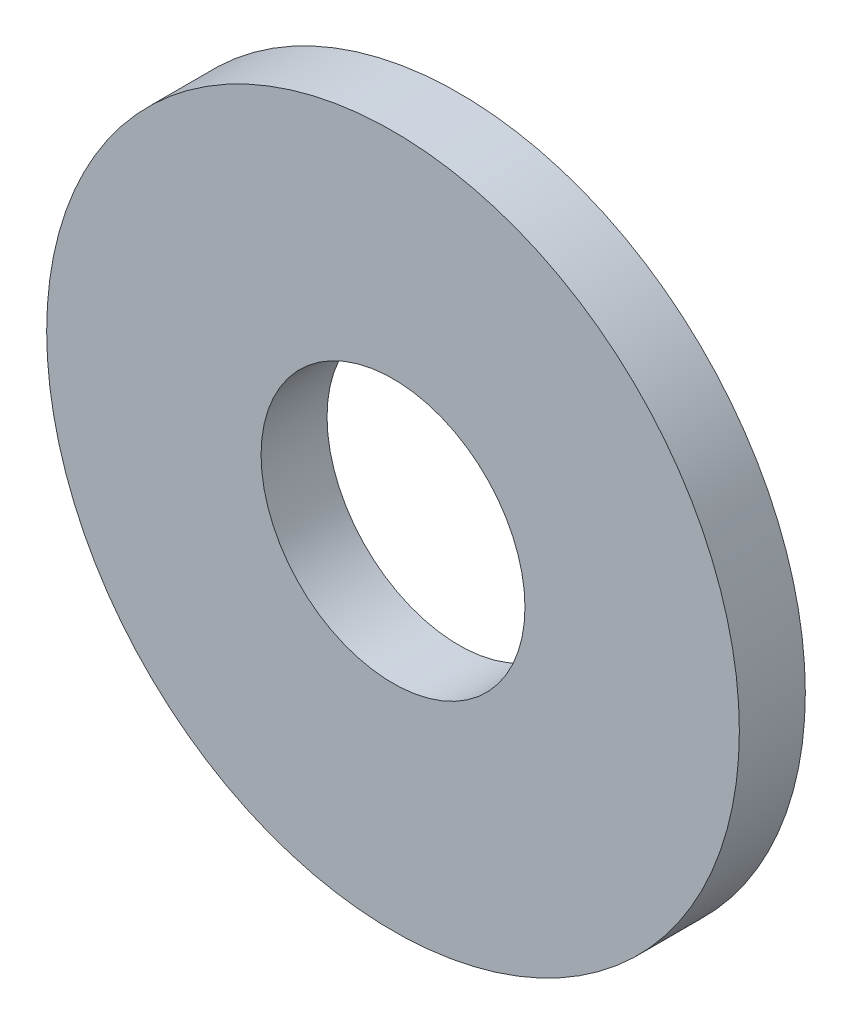
ISO-10303-21;
HEADER;
FILE_DESCRIPTION(('STEP AP214'),'2;1');
FILE_NAME('part.step','',(''),(''),'','','');
FILE_SCHEMA(('AUTOMOTIVE_DESIGN { 1 0 10303 214 1 1 1 1 }'));
ENDSEC;
DATA;
#1=APPLICATION_CONTEXT('core data for automotive mechanical design processes');
#2=APPLICATION_PROTOCOL_DEFINITION('international standard','automotive_design',2000,#1);
#3=PRODUCT_CONTEXT('',#1,'mechanical');
#4=PRODUCT('Part','Part','',(#3));
#5=PRODUCT_RELATED_PRODUCT_CATEGORY('part','',(#4));
#6=PRODUCT_DEFINITION_FORMATION('','',#4);
#7=PRODUCT_DEFINITION_CONTEXT('part definition',#1,'design');
#8=PRODUCT_DEFINITION('design','',#6,#7);
#9=PRODUCT_DEFINITION_SHAPE('','',#8);
#10=(LENGTH_UNIT() NAMED_UNIT(*) SI_UNIT(.MILLI.,.METRE.));
#11=(NAMED_UNIT(*) PLANE_ANGLE_UNIT() SI_UNIT($,.RADIAN.));
#12=(NAMED_UNIT(*) SI_UNIT($,.STERADIAN.) SOLID_ANGLE_UNIT());
#13=UNCERTAINTY_MEASURE_WITH_UNIT(LENGTH_MEASURE(1.E-05),#10,'distance_accuracy_value','');
#14=(GEOMETRIC_REPRESENTATION_CONTEXT(3) GLOBAL_UNCERTAINTY_ASSIGNED_CONTEXT((#13)) GLOBAL_UNIT_ASSIGNED_CONTEXT((#10,
#11,#12)) REPRESENTATION_CONTEXT('',''));
#15=CARTESIAN_POINT('',(0.,0.,0.));
#16=DIRECTION('',(0.,0.,1.));
#17=DIRECTION('',(1.,0.,0.));
#18=AXIS2_PLACEMENT_3D('',#15,#16,#17);
#19=CARTESIAN_POINT('',(0.,0.,2.));
#20=DIRECTION('',(0.,0.,1.));
#21=DIRECTION('',(1.,0.,0.));
#22=AXIS2_PLACEMENT_3D('',#19,#20,#21);
#23=PLANE('',#22);
#24=CARTESIAN_POINT('',(0.,0.,2.));
#25=DIRECTION('',(0.,0.,1.));
#26=DIRECTION('',(1.,0.,0.));
#27=AXIS2_PLACEMENT_3D('',#24,#25,#26);
#28=CIRCLE('',#27,10.5);
#29=CARTESIAN_POINT('',(10.5,0.,2.));
#30=VERTEX_POINT('',#29);
#31=EDGE_CURVE('E10',#30,#30,#28,.T.);
#32=ORIENTED_EDGE('',*,*,#31,.T.);
#33=EDGE_LOOP('',(#32));
#34=FACE_BOUND('',#33,.T.);
#35=CARTESIAN_POINT('',(0.,0.,2.));
#36=DIRECTION('',(0.,0.,1.));
#37=DIRECTION('',(1.,0.,0.));
#38=AXIS2_PLACEMENT_3D('',#35,#36,#37);
#39=CIRCLE('',#38,4.);
#40=CARTESIAN_POINT('',(4.,0.,2.));
#41=VERTEX_POINT('',#40);
#42=EDGE_CURVE('E54',#41,#41,#39,.T.);
#43=ORIENTED_EDGE('',*,*,#42,.F.);
#44=EDGE_LOOP('',(#43));
#45=FACE_BOUND('',#44,.T.);
#46=ADVANCED_FACE('F41',(#34,#45),#23,.T.);
#47=CARTESIAN_POINT('',(0.,0.,0.));
#48=DIRECTION('',(0.,0.,1.));
#49=DIRECTION('',(1.,0.,0.));
#50=AXIS2_PLACEMENT_3D('',#47,#48,#49);
#51=PLANE('',#50);
#52=CARTESIAN_POINT('',(0.,0.,0.));
#53=DIRECTION('',(0.,0.,1.));
#54=DIRECTION('',(1.,0.,0.));
#55=AXIS2_PLACEMENT_3D('',#52,#53,#54);
#56=CIRCLE('',#55,10.5);
#57=CARTESIAN_POINT('',(10.5,0.,0.));
#58=VERTEX_POINT('',#57);
#59=EDGE_CURVE('E45',#58,#58,#56,.T.);
#60=ORIENTED_EDGE('',*,*,#59,.F.);
#61=EDGE_LOOP('',(#60));
#62=FACE_BOUND('',#61,.T.);
#63=CARTESIAN_POINT('',(0.,0.,0.));
#64=DIRECTION('',(0.,0.,1.));
#65=DIRECTION('',(1.,0.,0.));
#66=AXIS2_PLACEMENT_3D('',#63,#64,#65);
#67=CIRCLE('',#66,4.);
#68=CARTESIAN_POINT('',(4.,0.,0.));
#69=VERTEX_POINT('',#68);
#70=EDGE_CURVE('E56',#69,#69,#67,.T.);
#71=ORIENTED_EDGE('',*,*,#70,.T.);
#72=EDGE_LOOP('',(#71));
#73=FACE_BOUND('',#72,.T.);
#74=ADVANCED_FACE('F68',(#62,#73),#51,.F.);
#75=CARTESIAN_POINT('',(0.,0.,2.));
#76=DIRECTION('',(0.,0.,-1.));
#77=DIRECTION('',(-1.,0.,0.));
#78=AXIS2_PLACEMENT_3D('',#75,#76,#77);
#79=CYLINDRICAL_SURFACE('',#78,10.5);
#80=ORIENTED_EDGE('',*,*,#31,.F.);
#81=EDGE_LOOP('',(#80));
#82=FACE_BOUND('',#81,.T.);
#83=ORIENTED_EDGE('',*,*,#59,.T.);
#84=EDGE_LOOP('',(#83));
#85=FACE_BOUND('',#84,.T.);
#86=ADVANCED_FACE('F43',(#82,#85),#79,.T.);
#87=CARTESIAN_POINT('',(0.,0.,2.));
#88=DIRECTION('',(0.,0.,-1.));
#89=DIRECTION('',(-1.,0.,0.));
#90=AXIS2_PLACEMENT_3D('',#87,#88,#89);
#91=CYLINDRICAL_SURFACE('',#90,4.);
#92=ORIENTED_EDGE('',*,*,#42,.T.);
#93=EDGE_LOOP('',(#92));
#94=FACE_BOUND('',#93,.T.);
#95=ORIENTED_EDGE('',*,*,#70,.F.);
#96=EDGE_LOOP('',(#95));
#97=FACE_BOUND('',#96,.T.);
#98=ADVANCED_FACE('F64',(#94,#97),#91,.F.);
#99=CLOSED_SHELL('',(#46,#74,#86,#98));
#100=MANIFOLD_SOLID_BREP('B2',#99);
#101=ADVANCED_BREP_SHAPE_REPRESENTATION('',(#18,#100),#14);
#102=SHAPE_DEFINITION_REPRESENTATION(#9,#101);
ENDSEC;
END-ISO-10303-21;
